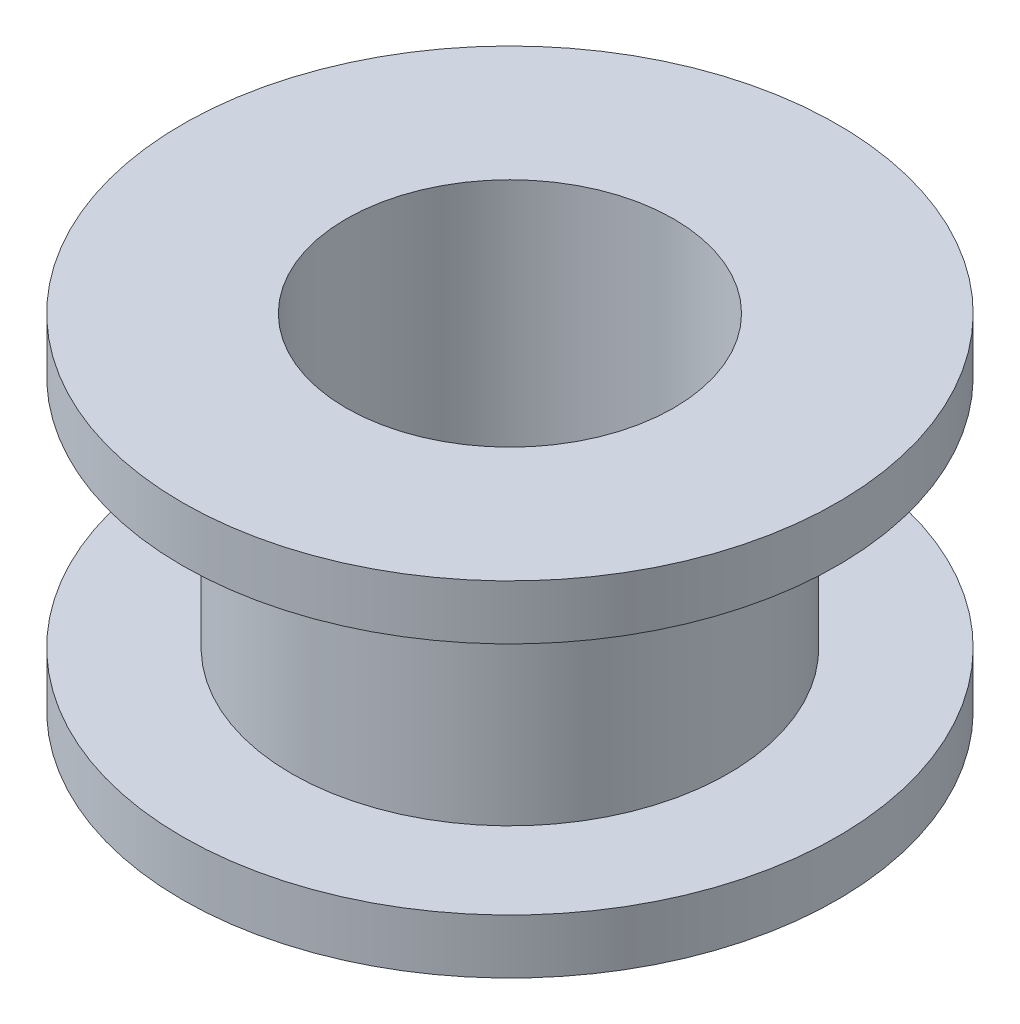
ISO-10303-21;
HEADER;
FILE_DESCRIPTION(('STEP AP214'),'2;1');
FILE_NAME('part.step','',(''),(''),'','','');
FILE_SCHEMA(('AUTOMOTIVE_DESIGN { 1 0 10303 214 1 1 1 1 }'));
ENDSEC;
DATA;
#1=APPLICATION_CONTEXT('core data for automotive mechanical design processes');
#2=APPLICATION_PROTOCOL_DEFINITION('international standard','automotive_design',2000,#1);
#3=PRODUCT_CONTEXT('',#1,'mechanical');
#4=PRODUCT('Part','Part','',(#3));
#5=PRODUCT_RELATED_PRODUCT_CATEGORY('part','',(#4));
#6=PRODUCT_DEFINITION_FORMATION('','',#4);
#7=PRODUCT_DEFINITION_CONTEXT('part definition',#1,'design');
#8=PRODUCT_DEFINITION('design','',#6,#7);
#9=PRODUCT_DEFINITION_SHAPE('','',#8);
#10=(LENGTH_UNIT() NAMED_UNIT(*) SI_UNIT(.MILLI.,.METRE.));
#11=(NAMED_UNIT(*) PLANE_ANGLE_UNIT() SI_UNIT($,.RADIAN.));
#12=(NAMED_UNIT(*) SI_UNIT($,.STERADIAN.) SOLID_ANGLE_UNIT());
#13=UNCERTAINTY_MEASURE_WITH_UNIT(LENGTH_MEASURE(1.E-05),#10,'distance_accuracy_value','');
#14=(GEOMETRIC_REPRESENTATION_CONTEXT(3) GLOBAL_UNCERTAINTY_ASSIGNED_CONTEXT((#13)) GLOBAL_UNIT_ASSIGNED_CONTEXT((#10,
#11,#12)) REPRESENTATION_CONTEXT('',''));
#15=CARTESIAN_POINT('',(0.,0.,0.));
#16=DIRECTION('',(0.,0.,1.));
#17=DIRECTION('',(1.,0.,0.));
#18=AXIS2_PLACEMENT_3D('',#15,#16,#17);
#19=CARTESIAN_POINT('',(0.,3.225,0.));
#20=DIRECTION('',(0.,-1.,0.));
#21=DIRECTION('',(0.,0.,-1.));
#22=AXIS2_PLACEMENT_3D('',#19,#20,#21);
#23=CYLINDRICAL_SURFACE('',#22,6.);
#24=CARTESIAN_POINT('',(0.,3.225,0.));
#25=DIRECTION('',(0.,1.,0.));
#26=DIRECTION('',(0.,0.,1.));
#27=AXIS2_PLACEMENT_3D('',#24,#25,#26);
#28=CIRCLE('',#27,6.);
#29=CARTESIAN_POINT('',(0.,3.225,6.));
#30=VERTEX_POINT('',#29);
#31=EDGE_CURVE('E10',#30,#30,#28,.T.);
#32=ORIENTED_EDGE('',*,*,#31,.F.);
#33=EDGE_LOOP('',(#32));
#34=FACE_BOUND('',#33,.T.);
#35=CARTESIAN_POINT('',(0.,-3.225,0.));
#36=DIRECTION('',(0.,-1.,0.));
#37=DIRECTION('',(0.,0.,-1.));
#38=AXIS2_PLACEMENT_3D('',#35,#36,#37);
#39=CIRCLE('',#38,6.);
#40=CARTESIAN_POINT('',(0.,-3.225,-6.));
#41=VERTEX_POINT('',#40);
#42=EDGE_CURVE('E60',#41,#41,#39,.T.);
#43=ORIENTED_EDGE('',*,*,#42,.F.);
#44=EDGE_LOOP('',(#43));
#45=FACE_BOUND('',#44,.T.);
#46=ADVANCED_FACE('F37',(#34,#45),#23,.T.);
#47=CARTESIAN_POINT('',(0.,3.225,0.));
#48=DIRECTION('',(0.,-1.,0.));
#49=DIRECTION('',(0.,0.,-1.));
#50=AXIS2_PLACEMENT_3D('',#47,#48,#49);
#51=CYLINDRICAL_SURFACE('',#50,4.5);
#52=CARTESIAN_POINT('',(0.,4.725,0.));
#53=DIRECTION('',(0.,1.,0.));
#54=DIRECTION('',(0.,0.,1.));
#55=AXIS2_PLACEMENT_3D('',#52,#53,#54);
#56=CIRCLE('',#55,4.5);
#57=CARTESIAN_POINT('',(0.,4.725,4.5));
#58=VERTEX_POINT('',#57);
#59=EDGE_CURVE('E55',#58,#58,#56,.T.);
#60=ORIENTED_EDGE('',*,*,#59,.T.);
#61=EDGE_LOOP('',(#60));
#62=FACE_BOUND('',#61,.T.);
#63=CARTESIAN_POINT('',(0.,-4.725,0.));
#64=DIRECTION('',(0.,1.,0.));
#65=DIRECTION('',(0.,0.,1.));
#66=AXIS2_PLACEMENT_3D('',#63,#64,#65);
#67=CIRCLE('',#66,4.5);
#68=CARTESIAN_POINT('',(0.,-4.725,4.5));
#69=VERTEX_POINT('',#68);
#70=EDGE_CURVE('E69',#69,#69,#67,.T.);
#71=ORIENTED_EDGE('',*,*,#70,.F.);
#72=EDGE_LOOP('',(#71));
#73=FACE_BOUND('',#72,.T.);
#74=ADVANCED_FACE('F80',(#62,#73),#51,.F.);
#75=CARTESIAN_POINT('',(0.,3.225,0.));
#76=DIRECTION('',(0.,1.,0.));
#77=DIRECTION('',(0.,0.,1.));
#78=AXIS2_PLACEMENT_3D('',#75,#76,#77);
#79=PLANE('',#78);
#80=CARTESIAN_POINT('',(0.,3.225,0.));
#81=DIRECTION('',(0.,1.,0.));
#82=DIRECTION('',(0.,0.,1.));
#83=AXIS2_PLACEMENT_3D('',#80,#81,#82);
#84=CIRCLE('',#83,9.);
#85=CARTESIAN_POINT('',(0.,3.225,9.));
#86=VERTEX_POINT('',#85);
#87=EDGE_CURVE('E49',#86,#86,#84,.T.);
#88=ORIENTED_EDGE('',*,*,#87,.F.);
#89=EDGE_LOOP('',(#88));
#90=FACE_BOUND('',#89,.T.);
#91=ORIENTED_EDGE('',*,*,#31,.T.);
#92=EDGE_LOOP('',(#91));
#93=FACE_BOUND('',#92,.T.);
#94=ADVANCED_FACE('F82',(#90,#93),#79,.F.);
#95=CARTESIAN_POINT('',(0.,4.725,0.));
#96=DIRECTION('',(0.,1.,0.));
#97=DIRECTION('',(0.,0.,1.));
#98=AXIS2_PLACEMENT_3D('',#95,#96,#97);
#99=PLANE('',#98);
#100=CARTESIAN_POINT('',(0.,4.725,0.));
#101=DIRECTION('',(0.,1.,0.));
#102=DIRECTION('',(0.,0.,1.));
#103=AXIS2_PLACEMENT_3D('',#100,#101,#102);
#104=CIRCLE('',#103,9.);
#105=CARTESIAN_POINT('',(0.,4.725,9.));
#106=VERTEX_POINT('',#105);
#107=EDGE_CURVE('E44',#106,#106,#104,.T.);
#108=ORIENTED_EDGE('',*,*,#107,.T.);
#109=EDGE_LOOP('',(#108));
#110=FACE_BOUND('',#109,.T.);
#111=ORIENTED_EDGE('',*,*,#59,.F.);
#112=EDGE_LOOP('',(#111));
#113=FACE_BOUND('',#112,.T.);
#114=ADVANCED_FACE('F88',(#110,#113),#99,.T.);
#115=CARTESIAN_POINT('',(0.,4.725,0.));
#116=DIRECTION('',(0.,-1.,0.));
#117=DIRECTION('',(0.,0.,-1.));
#118=AXIS2_PLACEMENT_3D('',#115,#116,#117);
#119=CYLINDRICAL_SURFACE('',#118,9.);
#120=ORIENTED_EDGE('',*,*,#107,.F.);
#121=EDGE_LOOP('',(#120));
#122=FACE_BOUND('',#121,.T.);
#123=ORIENTED_EDGE('',*,*,#87,.T.);
#124=EDGE_LOOP('',(#123));
#125=FACE_BOUND('',#124,.T.);
#126=ADVANCED_FACE('F93',(#122,#125),#119,.T.);
#127=CARTESIAN_POINT('',(0.,-3.225,0.));
#128=DIRECTION('',(0.,-1.,0.));
#129=DIRECTION('',(0.,0.,1.));
#130=AXIS2_PLACEMENT_3D('',#127,#128,#129);
#131=PLANE('',#130);
#132=CARTESIAN_POINT('',(0.,-3.225,0.));
#133=DIRECTION('',(0.,1.,0.));
#134=DIRECTION('',(0.,0.,1.));
#135=AXIS2_PLACEMENT_3D('',#132,#133,#134);
#136=CIRCLE('',#135,9.);
#137=CARTESIAN_POINT('',(0.,-3.225,9.));
#138=VERTEX_POINT('',#137);
#139=EDGE_CURVE('E65',#138,#138,#136,.T.);
#140=ORIENTED_EDGE('',*,*,#139,.T.);
#141=EDGE_LOOP('',(#140));
#142=FACE_BOUND('',#141,.T.);
#143=ORIENTED_EDGE('',*,*,#42,.T.);
#144=EDGE_LOOP('',(#143));
#145=FACE_BOUND('',#144,.T.);
#146=ADVANCED_FACE('F95',(#142,#145),#131,.F.);
#147=CARTESIAN_POINT('',(0.,-4.725,0.));
#148=DIRECTION('',(0.,1.,0.));
#149=DIRECTION('',(0.,0.,1.));
#150=AXIS2_PLACEMENT_3D('',#147,#148,#149);
#151=CYLINDRICAL_SURFACE('',#150,9.);
#152=CARTESIAN_POINT('',(0.,-4.725,0.));
#153=DIRECTION('',(0.,1.,0.));
#154=DIRECTION('',(0.,0.,1.));
#155=AXIS2_PLACEMENT_3D('',#152,#153,#154);
#156=CIRCLE('',#155,9.);
#157=CARTESIAN_POINT('',(0.,-4.725,9.));
#158=VERTEX_POINT('',#157);
#159=EDGE_CURVE('E64',#158,#158,#156,.T.);
#160=ORIENTED_EDGE('',*,*,#159,.T.);
#161=EDGE_LOOP('',(#160));
#162=FACE_BOUND('',#161,.T.);
#163=ORIENTED_EDGE('',*,*,#139,.F.);
#164=EDGE_LOOP('',(#163));
#165=FACE_BOUND('',#164,.T.);
#166=ADVANCED_FACE('F100',(#162,#165),#151,.T.);
#167=CARTESIAN_POINT('',(0.,-4.725,0.));
#168=DIRECTION('',(0.,-1.,0.));
#169=DIRECTION('',(0.,0.,1.));
#170=AXIS2_PLACEMENT_3D('',#167,#168,#169);
#171=PLANE('',#170);
#172=ORIENTED_EDGE('',*,*,#70,.T.);
#173=EDGE_LOOP('',(#172));
#174=FACE_BOUND('',#173,.T.);
#175=ORIENTED_EDGE('',*,*,#159,.F.);
#176=EDGE_LOOP('',(#175));
#177=FACE_BOUND('',#176,.T.);
#178=ADVANCED_FACE('F77',(#174,#177),#171,.T.);
#179=CLOSED_SHELL('',(#46,#74,#94,#114,#126,#146,#166,#178));
#180=MANIFOLD_SOLID_BREP('B2',#179);
#181=ADVANCED_BREP_SHAPE_REPRESENTATION('',(#18,#180),#14);
#182=SHAPE_DEFINITION_REPRESENTATION(#9,#181);
ENDSEC;
END-ISO-10303-21;
